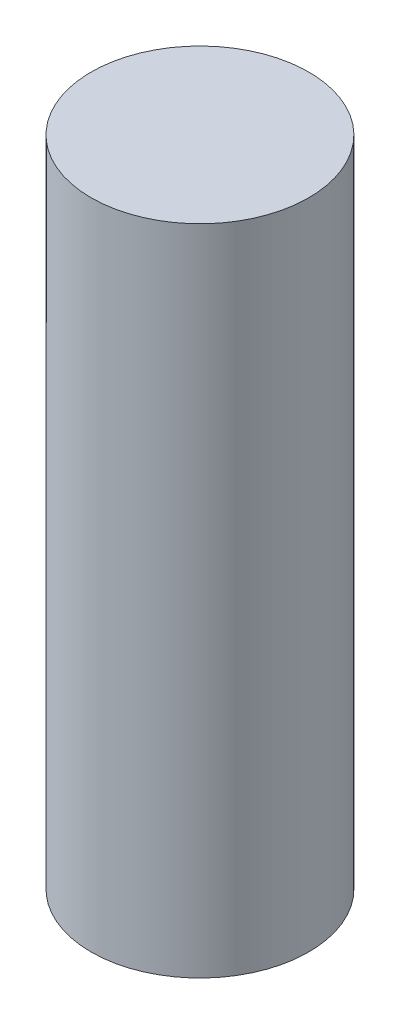
ISO-10303-21;
HEADER;
FILE_DESCRIPTION(('STEP AP214'),'2;1');
FILE_NAME('part.step','',(''),(''),'','','');
FILE_SCHEMA(('AUTOMOTIVE_DESIGN { 1 0 10303 214 1 1 1 1 }'));
ENDSEC;
DATA;
#1=APPLICATION_CONTEXT('core data for automotive mechanical design processes');
#2=APPLICATION_PROTOCOL_DEFINITION('international standard','automotive_design',2000,#1);
#3=PRODUCT_CONTEXT('',#1,'mechanical');
#4=PRODUCT('Part','Part','',(#3));
#5=PRODUCT_RELATED_PRODUCT_CATEGORY('part','',(#4));
#6=PRODUCT_DEFINITION_FORMATION('','',#4);
#7=PRODUCT_DEFINITION_CONTEXT('part definition',#1,'design');
#8=PRODUCT_DEFINITION('design','',#6,#7);
#9=PRODUCT_DEFINITION_SHAPE('','',#8);
#10=(LENGTH_UNIT() NAMED_UNIT(*) SI_UNIT(.MILLI.,.METRE.));
#11=(NAMED_UNIT(*) PLANE_ANGLE_UNIT() SI_UNIT($,.RADIAN.));
#12=(NAMED_UNIT(*) SI_UNIT($,.STERADIAN.) SOLID_ANGLE_UNIT());
#13=UNCERTAINTY_MEASURE_WITH_UNIT(LENGTH_MEASURE(1.E-05),#10,'distance_accuracy_value','');
#14=(GEOMETRIC_REPRESENTATION_CONTEXT(3) GLOBAL_UNCERTAINTY_ASSIGNED_CONTEXT((#13)) GLOBAL_UNIT_ASSIGNED_CONTEXT((#10,
#11,#12)) REPRESENTATION_CONTEXT('',''));
#15=CARTESIAN_POINT('',(0.,0.,0.));
#16=DIRECTION('',(0.,0.,1.));
#17=DIRECTION('',(1.,0.,0.));
#18=AXIS2_PLACEMENT_3D('',#15,#16,#17);
#19=CARTESIAN_POINT('',(0.,9.525,0.));
#20=DIRECTION('',(0.,-1.,0.));
#21=DIRECTION('',(0.,0.,-1.));
#22=AXIS2_PLACEMENT_3D('',#19,#20,#21);
#23=CYLINDRICAL_SURFACE('',#22,1.5875);
#24=CARTESIAN_POINT('',(0.,9.525,0.));
#25=DIRECTION('',(0.,1.,0.));
#26=DIRECTION('',(0.,0.,1.));
#27=AXIS2_PLACEMENT_3D('',#24,#25,#26);
#28=CIRCLE('',#27,1.5875);
#29=CARTESIAN_POINT('',(0.,9.525,1.5875));
#30=VERTEX_POINT('',#29);
#31=EDGE_CURVE('E11',#30,#30,#28,.T.);
#32=ORIENTED_EDGE('',*,*,#31,.F.);
#33=EDGE_LOOP('',(#32));
#34=FACE_BOUND('',#33,.T.);
#35=CARTESIAN_POINT('',(0.,0.,0.));
#36=DIRECTION('',(0.,1.,0.));
#37=DIRECTION('',(0.,0.,1.));
#38=AXIS2_PLACEMENT_3D('',#35,#36,#37);
#39=CIRCLE('',#38,1.5875);
#40=CARTESIAN_POINT('',(0.,0.,1.5875));
#41=VERTEX_POINT('',#40);
#42=EDGE_CURVE('E48',#41,#41,#39,.T.);
#43=ORIENTED_EDGE('',*,*,#42,.T.);
#44=EDGE_LOOP('',(#43));
#45=FACE_BOUND('',#44,.T.);
#46=ADVANCED_FACE('F45',(#34,#45),#23,.T.);
#47=CARTESIAN_POINT('',(0.,9.525,0.));
#48=DIRECTION('',(0.,1.,0.));
#49=DIRECTION('',(0.,0.,1.));
#50=AXIS2_PLACEMENT_3D('',#47,#48,#49);
#51=PLANE('',#50);
#52=ORIENTED_EDGE('',*,*,#31,.T.);
#53=EDGE_LOOP('',(#52));
#54=FACE_BOUND('',#53,.T.);
#55=ADVANCED_FACE('F78',(#54),#51,.T.);
#56=CARTESIAN_POINT('',(0.,0.,0.));
#57=DIRECTION('',(0.,1.,0.));
#58=DIRECTION('',(0.,0.,1.));
#59=AXIS2_PLACEMENT_3D('',#56,#57,#58);
#60=PLANE('',#59);
#61=CARTESIAN_POINT('',(0.,0.,0.));
#62=DIRECTION('',(0.,-1.,0.));
#63=DIRECTION('',(0.,0.,-1.));
#64=AXIS2_PLACEMENT_3D('',#61,#62,#63);
#65=CIRCLE('',#64,0.992250999999989);
#66=CARTESIAN_POINT('',(0.,0.,-0.992250999999989));
#67=VERTEX_POINT('',#66);
#68=EDGE_CURVE('E66',#67,#67,#65,.T.);
#69=ORIENTED_EDGE('',*,*,#68,.F.);
#70=EDGE_LOOP('',(#69));
#71=FACE_BOUND('',#70,.T.);
#72=ORIENTED_EDGE('',*,*,#42,.F.);
#73=EDGE_LOOP('',(#72));
#74=FACE_BOUND('',#73,.T.);
#75=ADVANCED_FACE('F59',(#71,#74),#60,.F.);
#76=CARTESIAN_POINT('',(0.,5.08,0.));
#77=DIRECTION('',(0.,-1.,0.));
#78=DIRECTION('',(0.,0.,-1.));
#79=AXIS2_PLACEMENT_3D('',#76,#77,#78);
#80=CONICAL_SURFACE('',#79,0.992250999999988,1.02974425867665);
#81=CARTESIAN_POINT('',(0.,5.67620455009071,0.));
#82=VERTEX_POINT('',#81);
#83=VERTEX_LOOP('',#82);
#84=FACE_BOUND('',#83,.T.);
#85=CARTESIAN_POINT('',(0.,5.08,0.));
#86=DIRECTION('',(0.,-1.,0.));
#87=DIRECTION('',(0.,0.,-1.));
#88=AXIS2_PLACEMENT_3D('',#85,#86,#87);
#89=CIRCLE('',#88,0.992250999999988);
#90=CARTESIAN_POINT('',(0.,5.08,-0.992250999999988));
#91=VERTEX_POINT('',#90);
#92=EDGE_CURVE('E63',#91,#91,#89,.T.);
#93=ORIENTED_EDGE('',*,*,#92,.T.);
#94=EDGE_LOOP('',(#93));
#95=FACE_BOUND('',#94,.T.);
#96=ADVANCED_FACE('F55',(#84,#95),#80,.F.);
#97=CARTESIAN_POINT('',(0.,0.,0.));
#98=DIRECTION('',(0.,-1.,0.));
#99=DIRECTION('',(0.,0.,-1.));
#100=AXIS2_PLACEMENT_3D('',#97,#98,#99);
#101=CYLINDRICAL_SURFACE('',#100,0.992250999999988);
#102=ORIENTED_EDGE('',*,*,#92,.F.);
#103=EDGE_LOOP('',(#102));
#104=FACE_BOUND('',#103,.T.);
#105=ORIENTED_EDGE('',*,*,#68,.T.);
#106=EDGE_LOOP('',(#105));
#107=FACE_BOUND('',#106,.T.);
#108=ADVANCED_FACE('F58',(#104,#107),#101,.F.);
#109=CLOSED_SHELL('',(#46,#55,#75,#96,#108));
#110=MANIFOLD_SOLID_BREP('B2',#109);
#111=ADVANCED_BREP_SHAPE_REPRESENTATION('',(#18,#110),#14);
#112=SHAPE_DEFINITION_REPRESENTATION(#9,#111);
ENDSEC;
END-ISO-10303-21;
